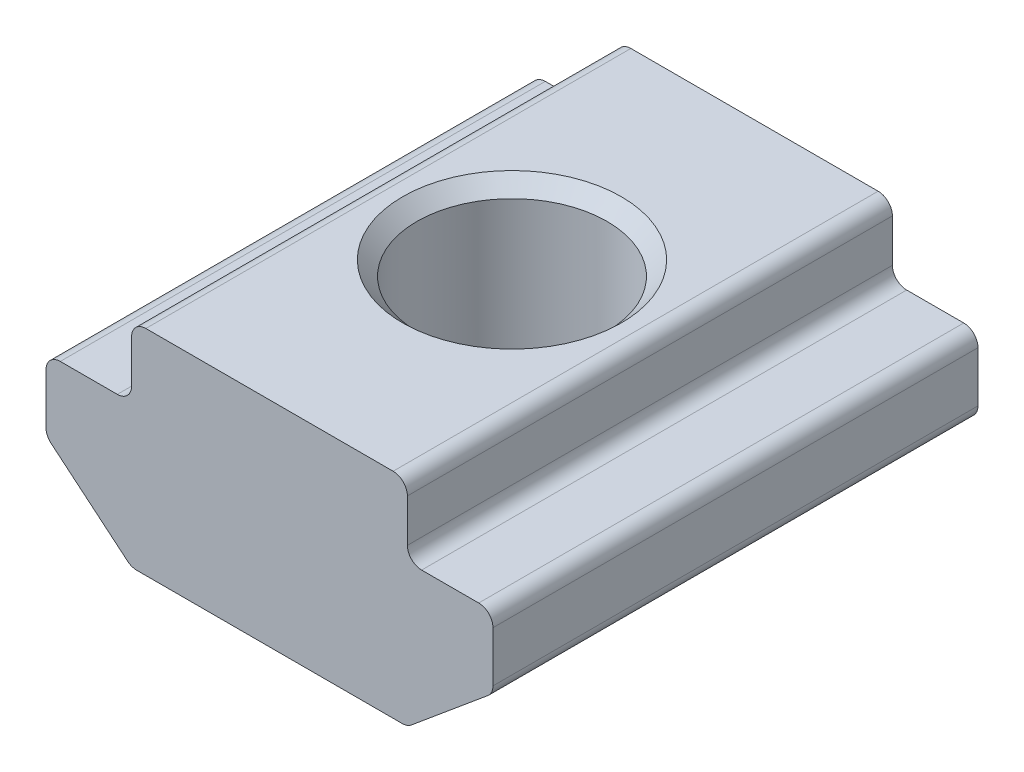
ISO-10303-21;
HEADER;
FILE_DESCRIPTION(('STEP AP214'),'2;1');
FILE_NAME('part.step','',(''),(''),'','','');
FILE_SCHEMA(('AUTOMOTIVE_DESIGN { 1 0 10303 214 1 1 1 1 }'));
ENDSEC;
DATA;
#1=APPLICATION_CONTEXT('core data for automotive mechanical design processes');
#2=APPLICATION_PROTOCOL_DEFINITION('international standard','automotive_design',2000,#1);
#3=PRODUCT_CONTEXT('',#1,'mechanical');
#4=PRODUCT('Part','Part','',(#3));
#5=PRODUCT_RELATED_PRODUCT_CATEGORY('part','',(#4));
#6=PRODUCT_DEFINITION_FORMATION('','',#4);
#7=PRODUCT_DEFINITION_CONTEXT('part definition',#1,'design');
#8=PRODUCT_DEFINITION('design','',#6,#7);
#9=PRODUCT_DEFINITION_SHAPE('','',#8);
#10=(LENGTH_UNIT() NAMED_UNIT(*) SI_UNIT(.MILLI.,.METRE.));
#11=(NAMED_UNIT(*) PLANE_ANGLE_UNIT() SI_UNIT($,.RADIAN.));
#12=(NAMED_UNIT(*) SI_UNIT($,.STERADIAN.) SOLID_ANGLE_UNIT());
#13=UNCERTAINTY_MEASURE_WITH_UNIT(LENGTH_MEASURE(1.E-05),#10,'distance_accuracy_value','');
#14=(GEOMETRIC_REPRESENTATION_CONTEXT(3) GLOBAL_UNCERTAINTY_ASSIGNED_CONTEXT((#13)) GLOBAL_UNIT_ASSIGNED_CONTEXT((#10,
#11,#12)) REPRESENTATION_CONTEXT('',''));
#15=CARTESIAN_POINT('',(0.,0.,0.));
#16=DIRECTION('',(0.,0.,1.));
#17=DIRECTION('',(1.,0.,0.));
#18=AXIS2_PLACEMENT_3D('',#15,#16,#17);
#19=CARTESIAN_POINT('',(-4.12240940493157,2.80807034325289,4.26467352863947));
#20=DIRECTION('',(1.,0.,0.));
#21=DIRECTION('',(0.,0.,-1.));
#22=AXIS2_PLACEMENT_3D('',#19,#20,#21);
#23=PLANE('',#22);
#24=DIRECTION('',(0.,-1.,0.));
#25=VECTOR('',#24,1.);
#26=CARTESIAN_POINT('',(-4.12240940493157,2.80807034325289,4.26467352863947));
#27=LINE('',#26,#25);
#28=CARTESIAN_POINT('',(-4.12240940493157,4.00807034325289,4.26467352863947));
#29=VERTEX_POINT('',#28);
#30=CARTESIAN_POINT('',(-4.12240940493157,3.10807034325289,4.26467352863947));
#31=VERTEX_POINT('',#30);
#32=EDGE_CURVE('E199',#29,#31,#27,.T.);
#33=ORIENTED_EDGE('',*,*,#32,.F.);
#34=DIRECTION('',(0.,0.,-1.));
#35=VECTOR('',#34,1.);
#36=CARTESIAN_POINT('',(-4.12240940493157,4.00807034325289,4.26467352863947));
#37=LINE('',#36,#35);
#38=CARTESIAN_POINT('',(-4.12240940493157,4.00807034325289,-5.93532647136053));
#39=VERTEX_POINT('',#38);
#40=EDGE_CURVE('E252',#29,#39,#37,.T.);
#41=ORIENTED_EDGE('',*,*,#40,.T.);
#42=DIRECTION('',(0.,-1.,0.));
#43=VECTOR('',#42,1.);
#44=CARTESIAN_POINT('',(-4.12240940493157,2.80807034325289,-5.93532647136053));
#45=LINE('',#44,#43);
#46=CARTESIAN_POINT('',(-4.12240940493157,3.10807034325289,-5.93532647136053));
#47=VERTEX_POINT('',#46);
#48=EDGE_CURVE('E362',#39,#47,#45,.T.);
#49=ORIENTED_EDGE('',*,*,#48,.T.);
#50=DIRECTION('',(0.,0.,-1.));
#51=VECTOR('',#50,1.);
#52=CARTESIAN_POINT('',(-4.12240940493157,3.10807034325289,4.26467352863947));
#53=LINE('',#52,#51);
#54=EDGE_CURVE('E250',#47,#31,#53,.F.);
#55=ORIENTED_EDGE('',*,*,#54,.T.);
#56=EDGE_LOOP('',(#33,#41,#49,#55));
#57=FACE_BOUND('',#56,.T.);
#58=ADVANCED_FACE('F16',(#57),#23,.F.);
#59=CARTESIAN_POINT('',(-5.92240940493157,2.80807034325289,4.26467352863947));
#60=DIRECTION('',(0.,-1.,0.));
#61=DIRECTION('',(0.,0.,-1.));
#62=AXIS2_PLACEMENT_3D('',#59,#60,#61);
#63=PLANE('',#62);
#64=DIRECTION('',(-1.,0.,0.));
#65=VECTOR('',#64,1.);
#66=CARTESIAN_POINT('',(-5.92240940493157,2.80807034325289,4.26467352863947));
#67=LINE('',#66,#65);
#68=CARTESIAN_POINT('',(-4.42240940493157,2.80807034325289,4.26467352863947));
#69=VERTEX_POINT('',#68);
#70=CARTESIAN_POINT('',(-5.62240940493157,2.80807034325289,4.26467352863947));
#71=VERTEX_POINT('',#70);
#72=EDGE_CURVE('E390',#69,#71,#67,.T.);
#73=ORIENTED_EDGE('',*,*,#72,.F.);
#74=DIRECTION('',(0.,0.,-1.));
#75=VECTOR('',#74,1.);
#76=CARTESIAN_POINT('',(-4.42240940493157,2.80807034325289,-5.93532647136053));
#77=LINE('',#76,#75);
#78=CARTESIAN_POINT('',(-4.42240940493157,2.80807034325289,-5.93532647136053));
#79=VERTEX_POINT('',#78);
#80=EDGE_CURVE('E257',#69,#79,#77,.T.);
#81=ORIENTED_EDGE('',*,*,#80,.T.);
#82=DIRECTION('',(-1.,0.,0.));
#83=VECTOR('',#82,1.);
#84=CARTESIAN_POINT('',(-5.92240940493157,2.80807034325289,-5.93532647136053));
#85=LINE('',#84,#83);
#86=CARTESIAN_POINT('',(-5.62240940493157,2.80807034325289,-5.93532647136053));
#87=VERTEX_POINT('',#86);
#88=EDGE_CURVE('E365',#79,#87,#85,.T.);
#89=ORIENTED_EDGE('',*,*,#88,.T.);
#90=DIRECTION('',(0.,0.,-1.));
#91=VECTOR('',#90,1.);
#92=CARTESIAN_POINT('',(-5.62240940493157,2.80807034325289,4.26467352863947));
#93=LINE('',#92,#91);
#94=EDGE_CURVE('E255',#87,#71,#93,.F.);
#95=ORIENTED_EDGE('',*,*,#94,.T.);
#96=EDGE_LOOP('',(#73,#81,#89,#95));
#97=FACE_BOUND('',#96,.T.);
#98=ADVANCED_FACE('F294',(#97),#63,.F.);
#99=CARTESIAN_POINT('',(-5.92240940493157,2.80807034325289,4.26467352863947));
#100=DIRECTION('',(1.,0.,0.));
#101=DIRECTION('',(0.,1.,0.));
#102=AXIS2_PLACEMENT_3D('',#99,#100,#101);
#103=PLANE('',#102);
#104=DIRECTION('',(0.,-1.,0.));
#105=VECTOR('',#104,1.);
#106=CARTESIAN_POINT('',(-5.92240940493157,2.80807034325289,-5.93532647136053));
#107=LINE('',#106,#105);
#108=CARTESIAN_POINT('',(-5.92240940493157,2.50807034325289,-5.93532647136053));
#109=VERTEX_POINT('',#108);
#110=CARTESIAN_POINT('',(-5.92240940493157,1.44858282704823,-5.93532647136053));
#111=VERTEX_POINT('',#110);
#112=EDGE_CURVE('E369',#109,#111,#107,.T.);
#113=ORIENTED_EDGE('',*,*,#112,.T.);
#114=DIRECTION('',(0.,0.,-1.));
#115=VECTOR('',#114,1.);
#116=CARTESIAN_POINT('',(-5.92240940493157,1.44858282704823,4.26467352863947));
#117=LINE('',#116,#115);
#118=CARTESIAN_POINT('',(-5.92240940493157,1.44858282704823,4.26467352863947));
#119=VERTEX_POINT('',#118);
#120=EDGE_CURVE('E263',#111,#119,#117,.F.);
#121=ORIENTED_EDGE('',*,*,#120,.T.);
#122=DIRECTION('',(0.,-1.,0.));
#123=VECTOR('',#122,1.);
#124=CARTESIAN_POINT('',(-5.92240940493157,2.80807034325289,4.26467352863947));
#125=LINE('',#124,#123);
#126=CARTESIAN_POINT('',(-5.92240940493157,2.50807034325289,4.26467352863947));
#127=VERTEX_POINT('',#126);
#128=EDGE_CURVE('E385',#127,#119,#125,.T.);
#129=ORIENTED_EDGE('',*,*,#128,.F.);
#130=DIRECTION('',(0.,0.,-1.));
#131=VECTOR('',#130,1.);
#132=CARTESIAN_POINT('',(-5.92240940493157,2.50807034325289,4.26467352863947));
#133=LINE('',#132,#131);
#134=EDGE_CURVE('E260',#127,#109,#133,.T.);
#135=ORIENTED_EDGE('',*,*,#134,.T.);
#136=EDGE_LOOP('',(#113,#121,#129,#135));
#137=FACE_BOUND('',#136,.T.);
#138=ADVANCED_FACE('F300',(#137),#103,.F.);
#139=CARTESIAN_POINT('',(-5.92240940493157,1.30807034325289,4.26467352863947));
#140=DIRECTION('',(0.64018439966448,0.768221279597376,0.));
#141=DIRECTION('',(-0.768221279597376,0.64018439966448,0.));
#142=AXIS2_PLACEMENT_3D('',#139,#140,#141);
#143=PLANE('',#142);
#144=DIRECTION('',(0.768221279597376,-0.64018439966448,0.));
#145=VECTOR('',#144,1.);
#146=CARTESIAN_POINT('',(-5.92240940493157,1.30807034325289,-5.93532647136053));
#147=LINE('',#146,#145);
#148=CARTESIAN_POINT('',(-5.81446472483091,1.21811644316901,-5.93532647136053));
#149=VERTEX_POINT('',#148);
#150=CARTESIAN_POINT('',(-4.20584974427651,-0.122396040626319,-5.93532647136053));
#151=VERTEX_POINT('',#150);
#152=EDGE_CURVE('E188',#149,#151,#147,.T.);
#153=ORIENTED_EDGE('',*,*,#152,.T.);
#154=DIRECTION('',(0.,0.,-1.));
#155=VECTOR('',#154,1.);
#156=CARTESIAN_POINT('',(-4.20584974427651,-0.122396040626319,4.26467352863947));
#157=LINE('',#156,#155);
#158=CARTESIAN_POINT('',(-4.20584974427651,-0.122396040626319,4.26467352863947));
#159=VERTEX_POINT('',#158);
#160=EDGE_CURVE('E234',#151,#159,#157,.F.);
#161=ORIENTED_EDGE('',*,*,#160,.T.);
#162=DIRECTION('',(0.768221279597376,-0.64018439966448,0.));
#163=VECTOR('',#162,1.);
#164=CARTESIAN_POINT('',(-5.92240940493157,1.30807034325289,4.26467352863947));
#165=LINE('',#164,#163);
#166=CARTESIAN_POINT('',(-5.81446472483091,1.21811644316901,4.26467352863947));
#167=VERTEX_POINT('',#166);
#168=EDGE_CURVE('E382',#167,#159,#165,.T.);
#169=ORIENTED_EDGE('',*,*,#168,.F.);
#170=DIRECTION('',(0.,0.,-1.));
#171=VECTOR('',#170,1.);
#172=CARTESIAN_POINT('',(-5.81446472483091,1.21811644316901,4.26467352863947));
#173=LINE('',#172,#171);
#174=EDGE_CURVE('E231',#167,#149,#173,.T.);
#175=ORIENTED_EDGE('',*,*,#174,.T.);
#176=EDGE_LOOP('',(#153,#161,#169,#175));
#177=FACE_BOUND('',#176,.T.);
#178=ADVANCED_FACE('F375',(#177),#143,.F.);
#179=CARTESIAN_POINT('',(1.67759059506843,-0.191929656747105,4.26467352863947));
#180=DIRECTION('',(0.,1.,0.));
#181=DIRECTION('',(-1.,0.,0.));
#182=AXIS2_PLACEMENT_3D('',#179,#180,#181);
#183=PLANE('',#182);
#184=CARTESIAN_POINT('',(-1.22240940493157,-0.191929656747107,-0.835326471360531));
#185=DIRECTION('',(0.,1.,0.));
#186=DIRECTION('',(-1.,0.,0.));
#187=AXIS2_PLACEMENT_3D('',#184,#185,#186);
#188=CIRCLE('',#187,2.);
#189=CARTESIAN_POINT('',(-3.22240940493157,-0.191929656747107,-0.835326471360531));
#190=VERTEX_POINT('',#189);
#191=EDGE_CURVE('E366',#190,#190,#188,.T.);
#192=ORIENTED_EDGE('',*,*,#191,.T.);
#193=EDGE_LOOP('',(#192));
#194=FACE_BOUND('',#193,.T.);
#195=DIRECTION('',(1.,0.,0.));
#196=VECTOR('',#195,1.);
#197=CARTESIAN_POINT('',(1.67759059506843,-0.191929656747105,-5.93532647136053));
#198=LINE('',#197,#196);
#199=CARTESIAN_POINT('',(-4.01379442437717,-0.191929656747106,-5.93532647136053));
#200=VERTEX_POINT('',#199);
#201=CARTESIAN_POINT('',(1.56897561451403,-0.191929656747105,-5.93532647136053));
#202=VERTEX_POINT('',#201);
#203=EDGE_CURVE('E183',#200,#202,#198,.T.);
#204=ORIENTED_EDGE('',*,*,#203,.T.);
#205=DIRECTION('',(0.,0.,-1.));
#206=VECTOR('',#205,1.);
#207=CARTESIAN_POINT('',(1.56897561451403,-0.191929656747105,4.26467352863947));
#208=LINE('',#207,#206);
#209=CARTESIAN_POINT('',(1.56897561451403,-0.191929656747105,4.26467352863947));
#210=VERTEX_POINT('',#209);
#211=EDGE_CURVE('E160',#202,#210,#208,.F.);
#212=ORIENTED_EDGE('',*,*,#211,.T.);
#213=DIRECTION('',(1.,0.,0.));
#214=VECTOR('',#213,1.);
#215=CARTESIAN_POINT('',(1.67759059506843,-0.191929656747105,4.26467352863947));
#216=LINE('',#215,#214);
#217=CARTESIAN_POINT('',(-4.01379442437717,-0.191929656747106,4.26467352863947));
#218=VERTEX_POINT('',#217);
#219=EDGE_CURVE('E356',#218,#210,#216,.T.);
#220=ORIENTED_EDGE('',*,*,#219,.F.);
#221=DIRECTION('',(0.,0.,-1.));
#222=VECTOR('',#221,1.);
#223=CARTESIAN_POINT('',(-4.01379442437717,-0.191929656747106,4.26467352863947));
#224=LINE('',#223,#222);
#225=EDGE_CURVE('E165',#218,#200,#224,.T.);
#226=ORIENTED_EDGE('',*,*,#225,.T.);
#227=EDGE_LOOP('',(#204,#212,#220,#226));
#228=FACE_BOUND('',#227,.T.);
#229=ADVANCED_FACE('F384',(#194,#228),#183,.F.);
#230=CARTESIAN_POINT('',(3.47759059506843,1.30807034325289,4.26467352863947));
#231=DIRECTION('',(-0.64018439966448,0.768221279597376,0.));
#232=DIRECTION('',(-0.768221279597376,-0.64018439966448,0.));
#233=AXIS2_PLACEMENT_3D('',#230,#231,#232);
#234=PLANE('',#233);
#235=DIRECTION('',(0.768221279597376,0.64018439966448,0.));
#236=VECTOR('',#235,1.);
#237=CARTESIAN_POINT('',(3.47759059506843,1.30807034325289,4.26467352863947));
#238=LINE('',#237,#236);
#239=CARTESIAN_POINT('',(1.76103093441338,-0.122396040626318,4.26467352863947));
#240=VERTEX_POINT('',#239);
#241=CARTESIAN_POINT('',(3.36964591496778,1.21811644316901,4.26467352863947));
#242=VERTEX_POINT('',#241);
#243=EDGE_CURVE('E175',#240,#242,#238,.T.);
#244=ORIENTED_EDGE('',*,*,#243,.F.);
#245=DIRECTION('',(0.,0.,-1.));
#246=VECTOR('',#245,1.);
#247=CARTESIAN_POINT('',(1.76103093441338,-0.122396040626318,4.26467352863947));
#248=LINE('',#247,#246);
#249=CARTESIAN_POINT('',(1.76103093441338,-0.122396040626318,-5.93532647136053));
#250=VERTEX_POINT('',#249);
#251=EDGE_CURVE('E159',#240,#250,#248,.T.);
#252=ORIENTED_EDGE('',*,*,#251,.T.);
#253=DIRECTION('',(0.768221279597376,0.64018439966448,0.));
#254=VECTOR('',#253,1.);
#255=CARTESIAN_POINT('',(3.47759059506843,1.30807034325289,-5.93532647136053));
#256=LINE('',#255,#254);
#257=CARTESIAN_POINT('',(3.36964591496778,1.21811644316901,-5.93532647136053));
#258=VERTEX_POINT('',#257);
#259=EDGE_CURVE('E172',#250,#258,#256,.T.);
#260=ORIENTED_EDGE('',*,*,#259,.T.);
#261=DIRECTION('',(0.,0.,-1.));
#262=VECTOR('',#261,1.);
#263=CARTESIAN_POINT('',(3.36964591496778,1.21811644316901,4.26467352863947));
#264=LINE('',#263,#262);
#265=EDGE_CURVE('E177',#258,#242,#264,.F.);
#266=ORIENTED_EDGE('',*,*,#265,.T.);
#267=EDGE_LOOP('',(#244,#252,#260,#266));
#268=FACE_BOUND('',#267,.T.);
#269=ADVANCED_FACE('F171',(#268),#234,.F.);
#270=CARTESIAN_POINT('',(3.47759059506843,2.80807034325289,4.26467352863947));
#271=DIRECTION('',(-1.,0.,0.));
#272=DIRECTION('',(0.,0.,1.));
#273=AXIS2_PLACEMENT_3D('',#270,#271,#272);
#274=PLANE('',#273);
#275=DIRECTION('',(0.,1.,0.));
#276=VECTOR('',#275,1.);
#277=CARTESIAN_POINT('',(3.47759059506843,2.80807034325289,4.26467352863947));
#278=LINE('',#277,#276);
#279=CARTESIAN_POINT('',(3.47759059506843,1.44858282704823,4.26467352863947));
#280=VERTEX_POINT('',#279);
#281=CARTESIAN_POINT('',(3.47759059506843,2.50807034325289,4.26467352863947));
#282=VERTEX_POINT('',#281);
#283=EDGE_CURVE('E346',#280,#282,#278,.T.);
#284=ORIENTED_EDGE('',*,*,#283,.F.);
#285=DIRECTION('',(0.,0.,-1.));
#286=VECTOR('',#285,1.);
#287=CARTESIAN_POINT('',(3.47759059506843,1.44858282704823,4.26467352863947));
#288=LINE('',#287,#286);
#289=CARTESIAN_POINT('',(3.47759059506843,1.44858282704823,-5.93532647136053));
#290=VERTEX_POINT('',#289);
#291=EDGE_CURVE('E267',#280,#290,#288,.T.);
#292=ORIENTED_EDGE('',*,*,#291,.T.);
#293=DIRECTION('',(0.,1.,0.));
#294=VECTOR('',#293,1.);
#295=CARTESIAN_POINT('',(3.47759059506843,2.80807034325289,-5.93532647136053));
#296=LINE('',#295,#294);
#297=CARTESIAN_POINT('',(3.47759059506843,2.50807034325289,-5.93532647136053));
#298=VERTEX_POINT('',#297);
#299=EDGE_CURVE('E182',#290,#298,#296,.T.);
#300=ORIENTED_EDGE('',*,*,#299,.T.);
#301=DIRECTION('',(0.,0.,-1.));
#302=VECTOR('',#301,1.);
#303=CARTESIAN_POINT('',(3.47759059506843,2.50807034325289,4.26467352863947));
#304=LINE('',#303,#302);
#305=EDGE_CURVE('E265',#298,#282,#304,.F.);
#306=ORIENTED_EDGE('',*,*,#305,.T.);
#307=EDGE_LOOP('',(#284,#292,#300,#306));
#308=FACE_BOUND('',#307,.T.);
#309=ADVANCED_FACE('F349',(#308),#274,.F.);
#310=CARTESIAN_POINT('',(1.67759059506843,2.80807034325289,4.26467352863947));
#311=DIRECTION('',(0.,-1.,0.));
#312=DIRECTION('',(0.,0.,-1.));
#313=AXIS2_PLACEMENT_3D('',#310,#311,#312);
#314=PLANE('',#313);
#315=DIRECTION('',(-1.,0.,0.));
#316=VECTOR('',#315,1.);
#317=CARTESIAN_POINT('',(1.67759059506843,2.80807034325289,-5.93532647136053));
#318=LINE('',#317,#316);
#319=CARTESIAN_POINT('',(3.17759059506843,2.80807034325289,-5.93532647136053));
#320=VERTEX_POINT('',#319);
#321=CARTESIAN_POINT('',(1.97759059506843,2.80807034325289,-5.93532647136053));
#322=VERTEX_POINT('',#321);
#323=EDGE_CURVE('E186',#320,#322,#318,.T.);
#324=ORIENTED_EDGE('',*,*,#323,.T.);
#325=DIRECTION('',(0.,0.,-1.));
#326=VECTOR('',#325,1.);
#327=CARTESIAN_POINT('',(1.97759059506843,2.80807034325289,4.26467352863947));
#328=LINE('',#327,#326);
#329=CARTESIAN_POINT('',(1.97759059506843,2.80807034325289,4.26467352863947));
#330=VERTEX_POINT('',#329);
#331=EDGE_CURVE('E244',#322,#330,#328,.F.);
#332=ORIENTED_EDGE('',*,*,#331,.T.);
#333=DIRECTION('',(-1.,0.,0.));
#334=VECTOR('',#333,1.);
#335=CARTESIAN_POINT('',(1.67759059506843,2.80807034325289,4.26467352863947));
#336=LINE('',#335,#334);
#337=CARTESIAN_POINT('',(3.17759059506843,2.80807034325289,4.26467352863947));
#338=VERTEX_POINT('',#337);
#339=EDGE_CURVE('E351',#338,#330,#336,.T.);
#340=ORIENTED_EDGE('',*,*,#339,.F.);
#341=DIRECTION('',(0.,0.,-1.));
#342=VECTOR('',#341,1.);
#343=CARTESIAN_POINT('',(3.17759059506843,2.80807034325289,4.26467352863947));
#344=LINE('',#343,#342);
#345=EDGE_CURVE('E241',#338,#320,#344,.T.);
#346=ORIENTED_EDGE('',*,*,#345,.T.);
#347=EDGE_LOOP('',(#324,#332,#340,#346));
#348=FACE_BOUND('',#347,.T.);
#349=ADVANCED_FACE('F414',(#348),#314,.F.);
#350=CARTESIAN_POINT('',(1.67759059506843,4.30807034325289,4.26467352863947));
#351=DIRECTION('',(-1.,0.,0.));
#352=DIRECTION('',(0.,-1.,0.));
#353=AXIS2_PLACEMENT_3D('',#350,#351,#352);
#354=PLANE('',#353);
#355=DIRECTION('',(0.,1.,0.));
#356=VECTOR('',#355,1.);
#357=CARTESIAN_POINT('',(1.67759059506843,4.30807034325289,4.26467352863947));
#358=LINE('',#357,#356);
#359=CARTESIAN_POINT('',(1.67759059506843,3.10807034325289,4.26467352863947));
#360=VERTEX_POINT('',#359);
#361=CARTESIAN_POINT('',(1.67759059506843,4.00807034325289,4.26467352863947));
#362=VERTEX_POINT('',#361);
#363=EDGE_CURVE('E354',#360,#362,#358,.T.);
#364=ORIENTED_EDGE('',*,*,#363,.F.);
#365=DIRECTION('',(0.,0.,-1.));
#366=VECTOR('',#365,1.);
#367=CARTESIAN_POINT('',(1.67759059506843,3.10807034325289,-5.93532647136053));
#368=LINE('',#367,#366);
#369=CARTESIAN_POINT('',(1.67759059506843,3.10807034325289,-5.93532647136053));
#370=VERTEX_POINT('',#369);
#371=EDGE_CURVE('E238',#360,#370,#368,.T.);
#372=ORIENTED_EDGE('',*,*,#371,.T.);
#373=DIRECTION('',(0.,1.,0.));
#374=VECTOR('',#373,1.);
#375=CARTESIAN_POINT('',(1.67759059506843,4.30807034325289,-5.93532647136053));
#376=LINE('',#375,#374);
#377=CARTESIAN_POINT('',(1.67759059506843,4.00807034325289,-5.93532647136053));
#378=VERTEX_POINT('',#377);
#379=EDGE_CURVE('E194',#370,#378,#376,.T.);
#380=ORIENTED_EDGE('',*,*,#379,.T.);
#381=DIRECTION('',(0.,0.,-1.));
#382=VECTOR('',#381,1.);
#383=CARTESIAN_POINT('',(1.67759059506843,4.00807034325289,4.26467352863947));
#384=LINE('',#383,#382);
#385=EDGE_CURVE('E236',#378,#362,#384,.F.);
#386=ORIENTED_EDGE('',*,*,#385,.T.);
#387=EDGE_LOOP('',(#364,#372,#380,#386));
#388=FACE_BOUND('',#387,.T.);
#389=ADVANCED_FACE('F410',(#388),#354,.F.);
#390=CARTESIAN_POINT('',(-4.12240940493157,4.30807034325289,4.26467352863947));
#391=DIRECTION('',(0.,-1.,0.));
#392=DIRECTION('',(0.,0.,-1.));
#393=AXIS2_PLACEMENT_3D('',#390,#391,#392);
#394=PLANE('',#393);
#395=CARTESIAN_POINT('',(-1.22240940493157,4.30807034325289,-0.835326471360531));
#396=DIRECTION('',(0.,-1.,0.));
#397=DIRECTION('',(0.,0.,-1.));
#398=AXIS2_PLACEMENT_3D('',#395,#396,#397);
#399=CIRCLE('',#398,2.3);
#400=CARTESIAN_POINT('',(-1.22240940493157,4.30807034325289,-3.13532647136053));
#401=VERTEX_POINT('',#400);
#402=EDGE_CURVE('E10',#401,#401,#399,.T.);
#403=ORIENTED_EDGE('',*,*,#402,.T.);
#404=EDGE_LOOP('',(#403));
#405=FACE_BOUND('',#404,.T.);
#406=DIRECTION('',(-1.,0.,0.));
#407=VECTOR('',#406,1.);
#408=CARTESIAN_POINT('',(-4.12240940493157,4.30807034325289,4.26467352863947));
#409=LINE('',#408,#407);
#410=CARTESIAN_POINT('',(1.37759059506843,4.30807034325289,4.26467352863947));
#411=VERTEX_POINT('',#410);
#412=CARTESIAN_POINT('',(-3.82240940493157,4.30807034325289,4.26467352863947));
#413=VERTEX_POINT('',#412);
#414=EDGE_CURVE('E200',#411,#413,#409,.T.);
#415=ORIENTED_EDGE('',*,*,#414,.F.);
#416=DIRECTION('',(0.,0.,-1.));
#417=VECTOR('',#416,1.);
#418=CARTESIAN_POINT('',(1.37759059506843,4.30807034325289,4.26467352863947));
#419=LINE('',#418,#417);
#420=CARTESIAN_POINT('',(1.37759059506843,4.30807034325289,-5.93532647136053));
#421=VERTEX_POINT('',#420);
#422=EDGE_CURVE('E247',#411,#421,#419,.T.);
#423=ORIENTED_EDGE('',*,*,#422,.T.);
#424=DIRECTION('',(-1.,0.,0.));
#425=VECTOR('',#424,1.);
#426=CARTESIAN_POINT('',(-4.12240940493157,4.30807034325289,-5.93532647136053));
#427=LINE('',#426,#425);
#428=CARTESIAN_POINT('',(-3.82240940493157,4.30807034325289,-5.93532647136053));
#429=VERTEX_POINT('',#428);
#430=EDGE_CURVE('E197',#421,#429,#427,.T.);
#431=ORIENTED_EDGE('',*,*,#430,.T.);
#432=DIRECTION('',(0.,0.,-1.));
#433=VECTOR('',#432,1.);
#434=CARTESIAN_POINT('',(-3.82240940493157,4.30807034325289,4.26467352863947));
#435=LINE('',#434,#433);
#436=EDGE_CURVE('E31',#429,#413,#435,.F.);
#437=ORIENTED_EDGE('',*,*,#436,.T.);
#438=EDGE_LOOP('',(#415,#423,#431,#437));
#439=FACE_BOUND('',#438,.T.);
#440=ADVANCED_FACE('F406',(#405,#439),#394,.F.);
#441=CARTESIAN_POINT('',(-1.22240940493157,2.05807034325289,4.26467352863947));
#442=DIRECTION('',(0.,0.,-1.));
#443=DIRECTION('',(-1.,0.,0.));
#444=AXIS2_PLACEMENT_3D('',#441,#442,#443);
#445=PLANE('',#444);
#446=ORIENTED_EDGE('',*,*,#219,.T.);
#447=CARTESIAN_POINT('',(1.56897561451403,0.108070343252894,4.26467352863947));
#448=DIRECTION('',(0.,0.,-1.));
#449=DIRECTION('',(-1.,0.,0.));
#450=AXIS2_PLACEMENT_3D('',#447,#448,#449);
#451=CIRCLE('',#450,0.3);
#452=EDGE_CURVE('E229',#210,#240,#451,.F.);
#453=ORIENTED_EDGE('',*,*,#452,.T.);
#454=ORIENTED_EDGE('',*,*,#243,.T.);
#455=CARTESIAN_POINT('',(3.17759059506843,1.44858282704823,4.26467352863947));
#456=DIRECTION('',(0.,0.,-1.));
#457=DIRECTION('',(-1.,0.,0.));
#458=AXIS2_PLACEMENT_3D('',#455,#456,#457);
#459=CIRCLE('',#458,0.3);
#460=EDGE_CURVE('E218',#242,#280,#459,.F.);
#461=ORIENTED_EDGE('',*,*,#460,.T.);
#462=ORIENTED_EDGE('',*,*,#283,.T.);
#463=CARTESIAN_POINT('',(3.17759059506843,2.50807034325289,4.26467352863947));
#464=DIRECTION('',(0.,0.,-1.));
#465=DIRECTION('',(-1.,0.,0.));
#466=AXIS2_PLACEMENT_3D('',#463,#464,#465);
#467=CIRCLE('',#466,0.3);
#468=EDGE_CURVE('E216',#282,#338,#467,.F.);
#469=ORIENTED_EDGE('',*,*,#468,.T.);
#470=ORIENTED_EDGE('',*,*,#339,.T.);
#471=CARTESIAN_POINT('',(1.97759059506843,3.10807034325289,4.26467352863947));
#472=DIRECTION('',(0.,0.,-1.));
#473=DIRECTION('',(-1.,0.,0.));
#474=AXIS2_PLACEMENT_3D('',#471,#472,#473);
#475=CIRCLE('',#474,0.3);
#476=EDGE_CURVE('E272',#330,#360,#475,.T.);
#477=ORIENTED_EDGE('',*,*,#476,.T.);
#478=ORIENTED_EDGE('',*,*,#363,.T.);
#479=CARTESIAN_POINT('',(1.37759059506843,4.00807034325289,4.26467352863947));
#480=DIRECTION('',(0.,0.,-1.));
#481=DIRECTION('',(-1.,0.,0.));
#482=AXIS2_PLACEMENT_3D('',#479,#480,#481);
#483=CIRCLE('',#482,0.3);
#484=EDGE_CURVE('E38',#362,#411,#483,.F.);
#485=ORIENTED_EDGE('',*,*,#484,.T.);
#486=ORIENTED_EDGE('',*,*,#414,.T.);
#487=CARTESIAN_POINT('',(-3.82240940493157,4.00807034325289,4.26467352863947));
#488=DIRECTION('',(0.,0.,-1.));
#489=DIRECTION('',(-1.,0.,0.));
#490=AXIS2_PLACEMENT_3D('',#487,#488,#489);
#491=CIRCLE('',#490,0.3);
#492=EDGE_CURVE('E224',#413,#29,#491,.F.);
#493=ORIENTED_EDGE('',*,*,#492,.T.);
#494=ORIENTED_EDGE('',*,*,#32,.T.);
#495=CARTESIAN_POINT('',(-4.42240940493157,3.10807034325289,4.26467352863947));
#496=DIRECTION('',(0.,0.,-1.));
#497=DIRECTION('',(-1.,0.,0.));
#498=AXIS2_PLACEMENT_3D('',#495,#496,#497);
#499=CIRCLE('',#498,0.3);
#500=EDGE_CURVE('E276',#31,#69,#499,.T.);
#501=ORIENTED_EDGE('',*,*,#500,.T.);
#502=ORIENTED_EDGE('',*,*,#72,.T.);
#503=CARTESIAN_POINT('',(-5.62240940493157,2.50807034325289,4.26467352863947));
#504=DIRECTION('',(0.,0.,-1.));
#505=DIRECTION('',(-1.,0.,0.));
#506=AXIS2_PLACEMENT_3D('',#503,#504,#505);
#507=CIRCLE('',#506,0.3);
#508=EDGE_CURVE('E220',#71,#127,#507,.F.);
#509=ORIENTED_EDGE('',*,*,#508,.T.);
#510=ORIENTED_EDGE('',*,*,#128,.T.);
#511=CARTESIAN_POINT('',(-5.62240940493157,1.44858282704823,4.26467352863947));
#512=DIRECTION('',(0.,0.,-1.));
#513=DIRECTION('',(-1.,0.,0.));
#514=AXIS2_PLACEMENT_3D('',#511,#512,#513);
#515=CIRCLE('',#514,0.3);
#516=EDGE_CURVE('E222',#119,#167,#515,.F.);
#517=ORIENTED_EDGE('',*,*,#516,.T.);
#518=ORIENTED_EDGE('',*,*,#168,.T.);
#519=CARTESIAN_POINT('',(-4.01379442437717,0.108070343252894,4.26467352863947));
#520=DIRECTION('',(0.,0.,-1.));
#521=DIRECTION('',(-1.,0.,0.));
#522=AXIS2_PLACEMENT_3D('',#519,#520,#521);
#523=CIRCLE('',#522,0.3);
#524=EDGE_CURVE('E227',#159,#218,#523,.F.);
#525=ORIENTED_EDGE('',*,*,#524,.T.);
#526=EDGE_LOOP('',(#446,#453,#454,#461,#462,#469,#470,#477,#478,#485,#486,#493,#494,#501,#502,
#509,#510,#517,#518,#525));
#527=FACE_BOUND('',#526,.T.);
#528=ADVANCED_FACE('F345',(#527),#445,.F.);
#529=CARTESIAN_POINT('',(-1.22240940493157,2.05807034325289,-5.93532647136053));
#530=DIRECTION('',(0.,0.,-1.));
#531=DIRECTION('',(-1.,0.,0.));
#532=AXIS2_PLACEMENT_3D('',#529,#530,#531);
#533=PLANE('',#532);
#534=ORIENTED_EDGE('',*,*,#259,.F.);
#535=CARTESIAN_POINT('',(1.56897561451403,0.108070343252894,-5.93532647136053));
#536=DIRECTION('',(0.,0.,-1.));
#537=DIRECTION('',(-1.,0.,0.));
#538=AXIS2_PLACEMENT_3D('',#535,#536,#537);
#539=CIRCLE('',#538,0.3);
#540=EDGE_CURVE('E155',#250,#202,#539,.T.);
#541=ORIENTED_EDGE('',*,*,#540,.T.);
#542=ORIENTED_EDGE('',*,*,#203,.F.);
#543=CARTESIAN_POINT('',(-4.01379442437717,0.108070343252894,-5.93532647136053));
#544=DIRECTION('',(0.,0.,-1.));
#545=DIRECTION('',(-1.,0.,0.));
#546=AXIS2_PLACEMENT_3D('',#543,#544,#545);
#547=CIRCLE('',#546,0.3);
#548=EDGE_CURVE('E166',#200,#151,#547,.T.);
#549=ORIENTED_EDGE('',*,*,#548,.T.);
#550=ORIENTED_EDGE('',*,*,#152,.F.);
#551=CARTESIAN_POINT('',(-5.62240940493157,1.44858282704823,-5.93532647136053));
#552=DIRECTION('',(0.,0.,-1.));
#553=DIRECTION('',(-1.,0.,0.));
#554=AXIS2_PLACEMENT_3D('',#551,#552,#553);
#555=CIRCLE('',#554,0.3);
#556=EDGE_CURVE('E206',#149,#111,#555,.T.);
#557=ORIENTED_EDGE('',*,*,#556,.T.);
#558=ORIENTED_EDGE('',*,*,#112,.F.);
#559=CARTESIAN_POINT('',(-5.62240940493157,2.50807034325289,-5.93532647136053));
#560=DIRECTION('',(0.,0.,-1.));
#561=DIRECTION('',(-1.,0.,0.));
#562=AXIS2_PLACEMENT_3D('',#559,#560,#561);
#563=CIRCLE('',#562,0.3);
#564=EDGE_CURVE('E204',#109,#87,#563,.T.);
#565=ORIENTED_EDGE('',*,*,#564,.T.);
#566=ORIENTED_EDGE('',*,*,#88,.F.);
#567=CARTESIAN_POINT('',(-4.42240940493157,3.10807034325289,-5.93532647136053));
#568=DIRECTION('',(0.,0.,-1.));
#569=DIRECTION('',(-1.,0.,0.));
#570=AXIS2_PLACEMENT_3D('',#567,#568,#569);
#571=CIRCLE('',#570,0.3);
#572=EDGE_CURVE('E274',#79,#47,#571,.F.);
#573=ORIENTED_EDGE('',*,*,#572,.T.);
#574=ORIENTED_EDGE('',*,*,#48,.F.);
#575=CARTESIAN_POINT('',(-3.82240940493157,4.00807034325289,-5.93532647136053));
#576=DIRECTION('',(0.,0.,-1.));
#577=DIRECTION('',(-1.,0.,0.));
#578=AXIS2_PLACEMENT_3D('',#575,#576,#577);
#579=CIRCLE('',#578,0.3);
#580=EDGE_CURVE('E208',#39,#429,#579,.T.);
#581=ORIENTED_EDGE('',*,*,#580,.T.);
#582=ORIENTED_EDGE('',*,*,#430,.F.);
#583=CARTESIAN_POINT('',(1.37759059506843,4.00807034325289,-5.93532647136053));
#584=DIRECTION('',(0.,0.,-1.));
#585=DIRECTION('',(-1.,0.,0.));
#586=AXIS2_PLACEMENT_3D('',#583,#584,#585);
#587=CIRCLE('',#586,0.3);
#588=EDGE_CURVE('E210',#421,#378,#587,.T.);
#589=ORIENTED_EDGE('',*,*,#588,.T.);
#590=ORIENTED_EDGE('',*,*,#379,.F.);
#591=CARTESIAN_POINT('',(1.97759059506843,3.10807034325289,-5.93532647136053));
#592=DIRECTION('',(0.,0.,-1.));
#593=DIRECTION('',(-1.,0.,0.));
#594=AXIS2_PLACEMENT_3D('',#591,#592,#593);
#595=CIRCLE('',#594,0.3);
#596=EDGE_CURVE('E270',#370,#322,#595,.F.);
#597=ORIENTED_EDGE('',*,*,#596,.T.);
#598=ORIENTED_EDGE('',*,*,#323,.F.);
#599=CARTESIAN_POINT('',(3.17759059506843,2.50807034325289,-5.93532647136053));
#600=DIRECTION('',(0.,0.,-1.));
#601=DIRECTION('',(-1.,0.,0.));
#602=AXIS2_PLACEMENT_3D('',#599,#600,#601);
#603=CIRCLE('',#602,0.3);
#604=EDGE_CURVE('E176',#320,#298,#603,.T.);
#605=ORIENTED_EDGE('',*,*,#604,.T.);
#606=ORIENTED_EDGE('',*,*,#299,.F.);
#607=CARTESIAN_POINT('',(3.17759059506843,1.44858282704823,-5.93532647136053));
#608=DIRECTION('',(0.,0.,-1.));
#609=DIRECTION('',(-1.,0.,0.));
#610=AXIS2_PLACEMENT_3D('',#607,#608,#609);
#611=CIRCLE('',#610,0.3);
#612=EDGE_CURVE('E181',#290,#258,#611,.T.);
#613=ORIENTED_EDGE('',*,*,#612,.T.);
#614=EDGE_LOOP('',(#534,#541,#542,#549,#550,#557,#558,#565,#566,#573,#574,#581,#582,#589,#590,
#597,#598,#605,#606,#613));
#615=FACE_BOUND('',#614,.T.);
#616=ADVANCED_FACE('F179',(#615),#533,.T.);
#617=CARTESIAN_POINT('',(-1.22240940493157,-0.191929656747107,-0.835326471360531));
#618=DIRECTION('',(0.,1.,0.));
#619=DIRECTION('',(-1.,0.,0.));
#620=AXIS2_PLACEMENT_3D('',#617,#618,#619);
#621=CYLINDRICAL_SURFACE('',#620,2.);
#622=CARTESIAN_POINT('',(-1.22240940493157,4.0080703432529,-0.835326471360531));
#623=DIRECTION('',(0.,-1.,0.));
#624=DIRECTION('',(1.,0.,0.));
#625=AXIS2_PLACEMENT_3D('',#622,#623,#624);
#626=CIRCLE('',#625,2.);
#627=CARTESIAN_POINT('',(0.777590595068433,4.0080703432529,-0.835326471360531));
#628=VERTEX_POINT('',#627);
#629=EDGE_CURVE('E24',#628,#628,#626,.F.);
#630=ORIENTED_EDGE('',*,*,#629,.T.);
#631=EDGE_LOOP('',(#630));
#632=FACE_BOUND('',#631,.T.);
#633=ORIENTED_EDGE('',*,*,#191,.F.);
#634=EDGE_LOOP('',(#633));
#635=FACE_BOUND('',#634,.T.);
#636=ADVANCED_FACE('F280',(#632,#635),#621,.F.);
#637=CARTESIAN_POINT('',(1.56897561451403,0.108070343252894,4.26467352863947));
#638=DIRECTION('',(0.,0.,-1.));
#639=DIRECTION('',(-1.,0.,0.));
#640=AXIS2_PLACEMENT_3D('',#637,#638,#639);
#641=CYLINDRICAL_SURFACE('',#640,0.3);
#642=ORIENTED_EDGE('',*,*,#452,.F.);
#643=ORIENTED_EDGE('',*,*,#211,.F.);
#644=ORIENTED_EDGE('',*,*,#540,.F.);
#645=ORIENTED_EDGE('',*,*,#251,.F.);
#646=EDGE_LOOP('',(#642,#643,#644,#645));
#647=FACE_BOUND('',#646,.T.);
#648=ADVANCED_FACE('F158',(#647),#641,.T.);
#649=CARTESIAN_POINT('',(-4.01379442437717,0.108070343252894,4.26467352863947));
#650=DIRECTION('',(0.,0.,-1.));
#651=DIRECTION('',(-1.,0.,0.));
#652=AXIS2_PLACEMENT_3D('',#649,#650,#651);
#653=CYLINDRICAL_SURFACE('',#652,0.3);
#654=ORIENTED_EDGE('',*,*,#524,.F.);
#655=ORIENTED_EDGE('',*,*,#160,.F.);
#656=ORIENTED_EDGE('',*,*,#548,.F.);
#657=ORIENTED_EDGE('',*,*,#225,.F.);
#658=EDGE_LOOP('',(#654,#655,#656,#657));
#659=FACE_BOUND('',#658,.T.);
#660=ADVANCED_FACE('F308',(#659),#653,.T.);
#661=CARTESIAN_POINT('',(1.97759059506843,3.10807034325289,4.26467352863947));
#662=DIRECTION('',(0.,0.,1.));
#663=DIRECTION('',(1.,0.,0.));
#664=AXIS2_PLACEMENT_3D('',#661,#662,#663);
#665=CYLINDRICAL_SURFACE('',#664,0.3);
#666=ORIENTED_EDGE('',*,*,#476,.F.);
#667=ORIENTED_EDGE('',*,*,#331,.F.);
#668=ORIENTED_EDGE('',*,*,#596,.F.);
#669=ORIENTED_EDGE('',*,*,#371,.F.);
#670=EDGE_LOOP('',(#666,#667,#668,#669));
#671=FACE_BOUND('',#670,.T.);
#672=ADVANCED_FACE('F311',(#671),#665,.F.);
#673=CARTESIAN_POINT('',(1.37759059506843,4.00807034325289,4.26467352863947));
#674=DIRECTION('',(0.,0.,-1.));
#675=DIRECTION('',(-1.,0.,0.));
#676=AXIS2_PLACEMENT_3D('',#673,#674,#675);
#677=CYLINDRICAL_SURFACE('',#676,0.3);
#678=ORIENTED_EDGE('',*,*,#484,.F.);
#679=ORIENTED_EDGE('',*,*,#385,.F.);
#680=ORIENTED_EDGE('',*,*,#588,.F.);
#681=ORIENTED_EDGE('',*,*,#422,.F.);
#682=EDGE_LOOP('',(#678,#679,#680,#681));
#683=FACE_BOUND('',#682,.T.);
#684=ADVANCED_FACE('F315',(#683),#677,.T.);
#685=CARTESIAN_POINT('',(-3.82240940493157,4.00807034325289,4.26467352863947));
#686=DIRECTION('',(0.,0.,-1.));
#687=DIRECTION('',(-1.,0.,0.));
#688=AXIS2_PLACEMENT_3D('',#685,#686,#687);
#689=CYLINDRICAL_SURFACE('',#688,0.3);
#690=ORIENTED_EDGE('',*,*,#492,.F.);
#691=ORIENTED_EDGE('',*,*,#436,.F.);
#692=ORIENTED_EDGE('',*,*,#580,.F.);
#693=ORIENTED_EDGE('',*,*,#40,.F.);
#694=EDGE_LOOP('',(#690,#691,#692,#693));
#695=FACE_BOUND('',#694,.T.);
#696=ADVANCED_FACE('F319',(#695),#689,.T.);
#697=CARTESIAN_POINT('',(-4.42240940493157,3.10807034325289,4.26467352863947));
#698=DIRECTION('',(0.,0.,1.));
#699=DIRECTION('',(1.,0.,0.));
#700=AXIS2_PLACEMENT_3D('',#697,#698,#699);
#701=CYLINDRICAL_SURFACE('',#700,0.3);
#702=ORIENTED_EDGE('',*,*,#500,.F.);
#703=ORIENTED_EDGE('',*,*,#54,.F.);
#704=ORIENTED_EDGE('',*,*,#572,.F.);
#705=ORIENTED_EDGE('',*,*,#80,.F.);
#706=EDGE_LOOP('',(#702,#703,#704,#705));
#707=FACE_BOUND('',#706,.T.);
#708=ADVANCED_FACE('F323',(#707),#701,.F.);
#709=CARTESIAN_POINT('',(-5.62240940493157,1.44858282704823,4.26467352863947));
#710=DIRECTION('',(0.,0.,-1.));
#711=DIRECTION('',(-1.,0.,0.));
#712=AXIS2_PLACEMENT_3D('',#709,#710,#711);
#713=CYLINDRICAL_SURFACE('',#712,0.3);
#714=ORIENTED_EDGE('',*,*,#516,.F.);
#715=ORIENTED_EDGE('',*,*,#120,.F.);
#716=ORIENTED_EDGE('',*,*,#556,.F.);
#717=ORIENTED_EDGE('',*,*,#174,.F.);
#718=EDGE_LOOP('',(#714,#715,#716,#717));
#719=FACE_BOUND('',#718,.T.);
#720=ADVANCED_FACE('F327',(#719),#713,.T.);
#721=CARTESIAN_POINT('',(-5.62240940493157,2.50807034325289,4.26467352863947));
#722=DIRECTION('',(0.,0.,-1.));
#723=DIRECTION('',(-1.,0.,0.));
#724=AXIS2_PLACEMENT_3D('',#721,#722,#723);
#725=CYLINDRICAL_SURFACE('',#724,0.3);
#726=ORIENTED_EDGE('',*,*,#508,.F.);
#727=ORIENTED_EDGE('',*,*,#94,.F.);
#728=ORIENTED_EDGE('',*,*,#564,.F.);
#729=ORIENTED_EDGE('',*,*,#134,.F.);
#730=EDGE_LOOP('',(#726,#727,#728,#729));
#731=FACE_BOUND('',#730,.T.);
#732=ADVANCED_FACE('F331',(#731),#725,.T.);
#733=CARTESIAN_POINT('',(3.17759059506843,1.44858282704823,4.26467352863947));
#734=DIRECTION('',(0.,0.,-1.));
#735=DIRECTION('',(-1.,0.,0.));
#736=AXIS2_PLACEMENT_3D('',#733,#734,#735);
#737=CYLINDRICAL_SURFACE('',#736,0.3);
#738=ORIENTED_EDGE('',*,*,#460,.F.);
#739=ORIENTED_EDGE('',*,*,#265,.F.);
#740=ORIENTED_EDGE('',*,*,#612,.F.);
#741=ORIENTED_EDGE('',*,*,#291,.F.);
#742=EDGE_LOOP('',(#738,#739,#740,#741));
#743=FACE_BOUND('',#742,.T.);
#744=ADVANCED_FACE('F290',(#743),#737,.T.);
#745=CARTESIAN_POINT('',(3.17759059506843,2.50807034325289,4.26467352863947));
#746=DIRECTION('',(0.,0.,-1.));
#747=DIRECTION('',(-1.,0.,0.));
#748=AXIS2_PLACEMENT_3D('',#745,#746,#747);
#749=CYLINDRICAL_SURFACE('',#748,0.3);
#750=ORIENTED_EDGE('',*,*,#468,.F.);
#751=ORIENTED_EDGE('',*,*,#305,.F.);
#752=ORIENTED_EDGE('',*,*,#604,.F.);
#753=ORIENTED_EDGE('',*,*,#345,.F.);
#754=EDGE_LOOP('',(#750,#751,#752,#753));
#755=FACE_BOUND('',#754,.T.);
#756=ADVANCED_FACE('F284',(#755),#749,.T.);
#757=CARTESIAN_POINT('',(-1.22240940493157,4.0080703432529,-0.835326471360531));
#758=DIRECTION('',(0.,1.,0.));
#759=DIRECTION('',(-1.,0.,0.));
#760=AXIS2_PLACEMENT_3D('',#757,#758,#759);
#761=CONICAL_SURFACE('',#760,2.,0.78539816339745);
#762=ORIENTED_EDGE('',*,*,#402,.F.);
#763=EDGE_LOOP('',(#762));
#764=FACE_BOUND('',#763,.T.);
#765=ORIENTED_EDGE('',*,*,#629,.F.);
#766=EDGE_LOOP('',(#765));
#767=FACE_BOUND('',#766,.T.);
#768=ADVANCED_FACE('F18',(#764,#767),#761,.F.);
#769=CLOSED_SHELL('',(#58,#98,#138,#178,#229,#269,#309,#349,#389,#440,#528,#616,#636,#648,#660,
#672,#684,#696,#708,#720,#732,#744,#756,#768));
#770=MANIFOLD_SOLID_BREP('B1',#769);
#771=ADVANCED_BREP_SHAPE_REPRESENTATION('',(#18,#770),#14);
#772=SHAPE_DEFINITION_REPRESENTATION(#9,#771);
ENDSEC;
END-ISO-10303-21;
